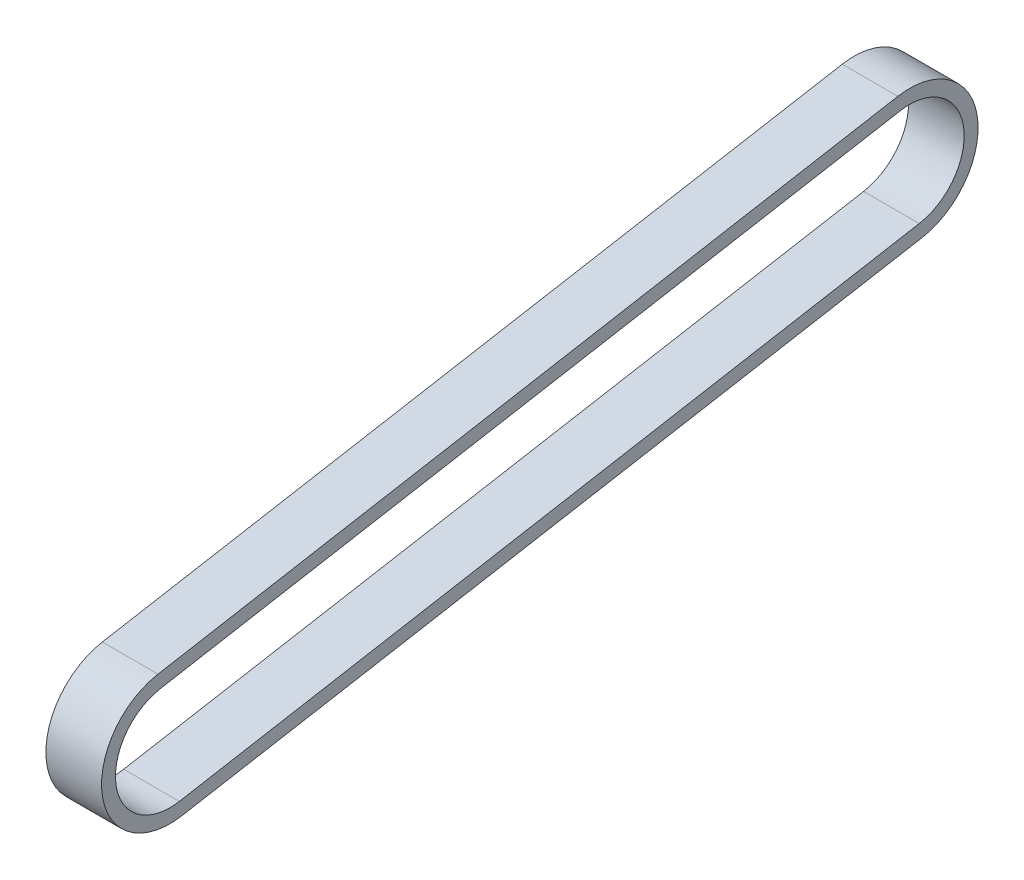
ISO-10303-21;
HEADER;
FILE_DESCRIPTION(('STEP AP214'),'2;1');
FILE_NAME('part.step','',(''),(''),'','','');
FILE_SCHEMA(('AUTOMOTIVE_DESIGN { 1 0 10303 214 1 1 1 1 }'));
ENDSEC;
DATA;
#1=APPLICATION_CONTEXT('core data for automotive mechanical design processes');
#2=APPLICATION_PROTOCOL_DEFINITION('international standard','automotive_design',2000,#1);
#3=PRODUCT_CONTEXT('',#1,'mechanical');
#4=PRODUCT('Part','Part','',(#3));
#5=PRODUCT_RELATED_PRODUCT_CATEGORY('part','',(#4));
#6=PRODUCT_DEFINITION_FORMATION('','',#4);
#7=PRODUCT_DEFINITION_CONTEXT('part definition',#1,'design');
#8=PRODUCT_DEFINITION('design','',#6,#7);
#9=PRODUCT_DEFINITION_SHAPE('','',#8);
#10=(LENGTH_UNIT() NAMED_UNIT(*) SI_UNIT(.MILLI.,.METRE.));
#11=(NAMED_UNIT(*) PLANE_ANGLE_UNIT() SI_UNIT($,.RADIAN.));
#12=(NAMED_UNIT(*) SI_UNIT($,.STERADIAN.) SOLID_ANGLE_UNIT());
#13=UNCERTAINTY_MEASURE_WITH_UNIT(LENGTH_MEASURE(1.E-05),#10,'distance_accuracy_value','');
#14=(GEOMETRIC_REPRESENTATION_CONTEXT(3) GLOBAL_UNCERTAINTY_ASSIGNED_CONTEXT((#13)) GLOBAL_UNIT_ASSIGNED_CONTEXT((#10,
#11,#12)) REPRESENTATION_CONTEXT('',''));
#15=CARTESIAN_POINT('',(0.,0.,0.));
#16=DIRECTION('',(0.,0.,1.));
#17=DIRECTION('',(1.,0.,0.));
#18=AXIS2_PLACEMENT_3D('',#15,#16,#17);
#19=CARTESIAN_POINT('',(-37.4500000000003,70.,-40.0000000000009));
#20=DIRECTION('',(1.,0.,0.));
#21=DIRECTION('',(0.,0.,-1.));
#22=AXIS2_PLACEMENT_3D('',#19,#20,#21);
#23=CYLINDRICAL_SURFACE('',#22,7.366);
#24=CARTESIAN_POINT('',(-31.4500000000003,70.,-40.0000000000008));
#25=DIRECTION('',(-1.,0.,0.));
#26=DIRECTION('',(0.,0.,1.));
#27=AXIS2_PLACEMENT_3D('',#24,#25,#26);
#28=CIRCLE('',#27,7.366);
#29=CARTESIAN_POINT('',(-31.4500000000003,77.2540939086879,-38.7209075233063));
#30=VERTEX_POINT('',#29);
#31=CARTESIAN_POINT('',(-31.4500000000003,62.7459060913121,-41.2790924766954));
#32=VERTEX_POINT('',#31);
#33=EDGE_CURVE('E135',#30,#32,#28,.T.);
#34=ORIENTED_EDGE('',*,*,#33,.T.);
#35=DIRECTION('',(1.,0.,0.));
#36=VECTOR('',#35,1.);
#37=CARTESIAN_POINT('',(-37.4500000000003,62.7459060913121,-41.2790924766955));
#38=LINE('',#37,#36);
#39=CARTESIAN_POINT('',(-37.4500000000003,62.7459060913121,-41.2790924766955));
#40=VERTEX_POINT('',#39);
#41=EDGE_CURVE('E12',#40,#32,#38,.T.);
#42=ORIENTED_EDGE('',*,*,#41,.F.);
#43=CARTESIAN_POINT('',(-37.4500000000003,70.,-40.0000000000009));
#44=DIRECTION('',(-1.,0.,0.));
#45=DIRECTION('',(0.,0.,1.));
#46=AXIS2_PLACEMENT_3D('',#43,#44,#45);
#47=CIRCLE('',#46,7.366);
#48=CARTESIAN_POINT('',(-37.4500000000003,77.2540939086879,-38.7209075233063));
#49=VERTEX_POINT('',#48);
#50=EDGE_CURVE('E165',#49,#40,#47,.T.);
#51=ORIENTED_EDGE('',*,*,#50,.F.);
#52=DIRECTION('',(1.,0.,0.));
#53=VECTOR('',#52,1.);
#54=CARTESIAN_POINT('',(-37.4500000000003,77.2540939086879,-38.7209075233063));
#55=LINE('',#54,#53);
#56=EDGE_CURVE('E176',#49,#30,#55,.T.);
#57=ORIENTED_EDGE('',*,*,#56,.T.);
#58=EDGE_LOOP('',(#34,#42,#51,#57));
#59=FACE_BOUND('',#58,.T.);
#60=ADVANCED_FACE('F63',(#59),#23,.T.);
#61=CARTESIAN_POINT('',(-37.4500000000003,62.7459060913121,-41.2790924766955));
#62=DIRECTION('',(0.,0.984807753012209,0.173648177666924));
#63=DIRECTION('',(0.,-0.173648177666924,0.984807753012209));
#64=AXIS2_PLACEMENT_3D('',#61,#62,#63);
#65=PLANE('',#64);
#66=DIRECTION('',(0.,-0.173648177666924,0.984807753012209));
#67=VECTOR('',#66,1.);
#68=CARTESIAN_POINT('',(-31.4500000000003,62.7459060913121,-41.2790924766954));
#69=LINE('',#68,#67);
#70=CARTESIAN_POINT('',(-31.4500000000008,48.6804037002912,38.4903355172935));
#71=VERTEX_POINT('',#70);
#72=EDGE_CURVE('E179',#32,#71,#69,.T.);
#73=ORIENTED_EDGE('',*,*,#72,.T.);
#74=DIRECTION('',(1.,0.,0.));
#75=VECTOR('',#74,1.);
#76=CARTESIAN_POINT('',(-37.4500000000008,48.6804037002912,38.4903355172935));
#77=LINE('',#76,#75);
#78=CARTESIAN_POINT('',(-37.4500000000008,48.6804037002912,38.4903355172935));
#79=VERTEX_POINT('',#78);
#80=EDGE_CURVE('E70',#79,#71,#77,.T.);
#81=ORIENTED_EDGE('',*,*,#80,.F.);
#82=DIRECTION('',(0.,-0.173648177666924,0.984807753012209));
#83=VECTOR('',#82,1.);
#84=CARTESIAN_POINT('',(-37.4500000000003,62.7459060913121,-41.2790924766955));
#85=LINE('',#84,#83);
#86=EDGE_CURVE('E168',#40,#79,#85,.T.);
#87=ORIENTED_EDGE('',*,*,#86,.F.);
#88=ORIENTED_EDGE('',*,*,#41,.T.);
#89=EDGE_LOOP('',(#73,#81,#87,#88));
#90=FACE_BOUND('',#89,.T.);
#91=ADVANCED_FACE('F205',(#90),#65,.F.);
#92=CARTESIAN_POINT('',(-37.4500000000008,55.9344976089792,39.7694279939881));
#93=DIRECTION('',(1.,0.,0.));
#94=DIRECTION('',(0.,0.,-1.));
#95=AXIS2_PLACEMENT_3D('',#92,#93,#94);
#96=CYLINDRICAL_SURFACE('',#95,7.36600000000001);
#97=CARTESIAN_POINT('',(-31.4500000000008,55.9344976089792,39.7694279939881));
#98=DIRECTION('',(-1.,0.,0.));
#99=DIRECTION('',(0.,0.,1.));
#100=AXIS2_PLACEMENT_3D('',#97,#98,#99);
#101=CIRCLE('',#100,7.36600000000001);
#102=CARTESIAN_POINT('',(-31.4500000000008,63.1885915176671,41.0485204706827));
#103=VERTEX_POINT('',#102);
#104=EDGE_CURVE('E181',#71,#103,#101,.T.);
#105=ORIENTED_EDGE('',*,*,#104,.T.);
#106=DIRECTION('',(1.,0.,0.));
#107=VECTOR('',#106,1.);
#108=CARTESIAN_POINT('',(-37.4500000000008,63.1885915176671,41.0485204706826));
#109=LINE('',#108,#107);
#110=CARTESIAN_POINT('',(-37.4500000000008,63.1885915176671,41.0485204706826));
#111=VERTEX_POINT('',#110);
#112=EDGE_CURVE('E187',#111,#103,#109,.T.);
#113=ORIENTED_EDGE('',*,*,#112,.F.);
#114=CARTESIAN_POINT('',(-37.4500000000008,55.9344976089792,39.7694279939881));
#115=DIRECTION('',(-1.,0.,0.));
#116=DIRECTION('',(0.,0.,1.));
#117=AXIS2_PLACEMENT_3D('',#114,#115,#116);
#118=CIRCLE('',#117,7.36600000000001);
#119=EDGE_CURVE('E171',#79,#111,#118,.T.);
#120=ORIENTED_EDGE('',*,*,#119,.F.);
#121=ORIENTED_EDGE('',*,*,#80,.T.);
#122=EDGE_LOOP('',(#105,#113,#120,#121));
#123=FACE_BOUND('',#122,.T.);
#124=ADVANCED_FACE('F193',(#123),#96,.T.);
#125=CARTESIAN_POINT('',(-37.4500000000003,77.2540939086879,-38.7209075233063));
#126=DIRECTION('',(0.,0.984807753012209,0.173648177666924));
#127=DIRECTION('',(0.,-0.173648177666924,0.984807753012209));
#128=AXIS2_PLACEMENT_3D('',#125,#126,#127);
#129=PLANE('',#128);
#130=DIRECTION('',(0.,-0.173648177666924,0.984807753012209));
#131=VECTOR('',#130,1.);
#132=CARTESIAN_POINT('',(-31.4500000000003,77.2540939086879,-38.7209075233063));
#133=LINE('',#132,#131);
#134=EDGE_CURVE('E169',#30,#103,#133,.T.);
#135=ORIENTED_EDGE('',*,*,#134,.F.);
#136=ORIENTED_EDGE('',*,*,#56,.F.);
#137=DIRECTION('',(0.,-0.173648177666924,0.984807753012209));
#138=VECTOR('',#137,1.);
#139=CARTESIAN_POINT('',(-37.4500000000003,77.2540939086879,-38.7209075233063));
#140=LINE('',#139,#138);
#141=EDGE_CURVE('E173',#49,#111,#140,.T.);
#142=ORIENTED_EDGE('',*,*,#141,.T.);
#143=ORIENTED_EDGE('',*,*,#112,.T.);
#144=EDGE_LOOP('',(#135,#136,#142,#143));
#145=FACE_BOUND('',#144,.T.);
#146=ADVANCED_FACE('F201',(#145),#129,.T.);
#147=CARTESIAN_POINT('',(-37.4500000000003,70.,-40.0000000000009));
#148=DIRECTION('',(-1.,0.,0.));
#149=DIRECTION('',(0.,0.,1.));
#150=AXIS2_PLACEMENT_3D('',#147,#148,#149);
#151=PLANE('',#150);
#152=DIRECTION('',(0.,-0.173648177666924,0.984807753012209));
#153=VECTOR('',#152,1.);
#154=CARTESIAN_POINT('',(-37.4500000000006,66.8257211401633,11.7831776423102));
#155=LINE('',#154,#153);
#156=CARTESIAN_POINT('',(-37.4500000000003,75.7768822791697,-38.9813797898067));
#157=VERTEX_POINT('',#156);
#158=CARTESIAN_POINT('',(-37.4500000000008,61.7113798881488,40.7880482041823));
#159=VERTEX_POINT('',#158);
#160=EDGE_CURVE('E139',#157,#159,#155,.T.);
#161=ORIENTED_EDGE('',*,*,#160,.T.);
#162=CARTESIAN_POINT('',(-37.4500000000008,55.9344976089792,39.7694279939881));
#163=DIRECTION('',(-1.,0.,0.));
#164=DIRECTION('',(0.,0.,1.));
#165=AXIS2_PLACEMENT_3D('',#162,#163,#164);
#166=CIRCLE('',#165,5.866);
#167=CARTESIAN_POINT('',(-37.4500000000008,50.1576153298095,38.7508077837939));
#168=VERTEX_POINT('',#167);
#169=EDGE_CURVE('E151',#168,#159,#166,.T.);
#170=ORIENTED_EDGE('',*,*,#169,.F.);
#171=DIRECTION('',(0.,-0.173648177666924,0.984807753012209));
#172=VECTOR('',#171,1.);
#173=CARTESIAN_POINT('',(-37.4500000000006,55.2719565818241,9.74593722192179));
#174=LINE('',#173,#172);
#175=CARTESIAN_POINT('',(-37.4500000000003,64.2231177208304,-41.0186202101951));
#176=VERTEX_POINT('',#175);
#177=EDGE_CURVE('E149',#176,#168,#174,.T.);
#178=ORIENTED_EDGE('',*,*,#177,.F.);
#179=CARTESIAN_POINT('',(-37.4500000000003,70.,-40.0000000000009));
#180=DIRECTION('',(-1.,0.,0.));
#181=DIRECTION('',(0.,0.,1.));
#182=AXIS2_PLACEMENT_3D('',#179,#180,#181);
#183=CIRCLE('',#182,5.866);
#184=EDGE_CURVE('E131',#157,#176,#183,.T.);
#185=ORIENTED_EDGE('',*,*,#184,.F.);
#186=EDGE_LOOP('',(#161,#170,#178,#185));
#187=FACE_BOUND('',#186,.T.);
#188=ORIENTED_EDGE('',*,*,#50,.T.);
#189=ORIENTED_EDGE('',*,*,#86,.T.);
#190=ORIENTED_EDGE('',*,*,#119,.T.);
#191=ORIENTED_EDGE('',*,*,#141,.F.);
#192=EDGE_LOOP('',(#188,#189,#190,#191));
#193=FACE_BOUND('',#192,.T.);
#194=ADVANCED_FACE('F147',(#187,#193),#151,.T.);
#195=CARTESIAN_POINT('',(-31.4500000000003,70.,-40.0000000000008));
#196=DIRECTION('',(-1.,0.,0.));
#197=DIRECTION('',(0.,0.,1.));
#198=AXIS2_PLACEMENT_3D('',#195,#196,#197);
#199=PLANE('',#198);
#200=CARTESIAN_POINT('',(-31.4500000000008,55.9344976089792,39.7694279939881));
#201=DIRECTION('',(-1.,0.,0.));
#202=DIRECTION('',(0.,0.,1.));
#203=AXIS2_PLACEMENT_3D('',#200,#201,#202);
#204=CIRCLE('',#203,5.866);
#205=CARTESIAN_POINT('',(-31.4500000000008,50.1576153298095,38.7508077837939));
#206=VERTEX_POINT('',#205);
#207=CARTESIAN_POINT('',(-31.4500000000008,61.7113798881488,40.7880482041823));
#208=VERTEX_POINT('',#207);
#209=EDGE_CURVE('E144',#206,#208,#204,.T.);
#210=ORIENTED_EDGE('',*,*,#209,.T.);
#211=DIRECTION('',(0.,-0.173648177666924,0.984807753012209));
#212=VECTOR('',#211,1.);
#213=CARTESIAN_POINT('',(-31.4500000000006,66.8257211401633,11.7831776423102));
#214=LINE('',#213,#212);
#215=CARTESIAN_POINT('',(-31.4500000000003,75.7768822791697,-38.9813797898067));
#216=VERTEX_POINT('',#215);
#217=EDGE_CURVE('E85',#216,#208,#214,.T.);
#218=ORIENTED_EDGE('',*,*,#217,.F.);
#219=CARTESIAN_POINT('',(-31.4500000000003,70.,-40.0000000000008));
#220=DIRECTION('',(-1.,0.,0.));
#221=DIRECTION('',(0.,0.,1.));
#222=AXIS2_PLACEMENT_3D('',#219,#220,#221);
#223=CIRCLE('',#222,5.866);
#224=CARTESIAN_POINT('',(-31.4500000000003,64.2231177208304,-41.018620210195));
#225=VERTEX_POINT('',#224);
#226=EDGE_CURVE('E134',#216,#225,#223,.T.);
#227=ORIENTED_EDGE('',*,*,#226,.T.);
#228=DIRECTION('',(0.,-0.173648177666924,0.984807753012209));
#229=VECTOR('',#228,1.);
#230=CARTESIAN_POINT('',(-31.4500000000006,55.2719565818241,9.74593722192184));
#231=LINE('',#230,#229);
#232=EDGE_CURVE('E157',#225,#206,#231,.T.);
#233=ORIENTED_EDGE('',*,*,#232,.T.);
#234=EDGE_LOOP('',(#210,#218,#227,#233));
#235=FACE_BOUND('',#234,.T.);
#236=ORIENTED_EDGE('',*,*,#33,.F.);
#237=ORIENTED_EDGE('',*,*,#134,.T.);
#238=ORIENTED_EDGE('',*,*,#104,.F.);
#239=ORIENTED_EDGE('',*,*,#72,.F.);
#240=EDGE_LOOP('',(#236,#237,#238,#239));
#241=FACE_BOUND('',#240,.T.);
#242=ADVANCED_FACE('F198',(#235,#241),#199,.F.);
#243=CARTESIAN_POINT('',(-37.4500000000006,66.8257211401633,11.7831776423102));
#244=DIRECTION('',(0.,0.984807753012209,0.173648177666924));
#245=DIRECTION('',(0.,-0.173648177666924,0.984807753012209));
#246=AXIS2_PLACEMENT_3D('',#243,#244,#245);
#247=PLANE('',#246);
#248=ORIENTED_EDGE('',*,*,#217,.T.);
#249=DIRECTION('',(1.,0.,0.));
#250=VECTOR('',#249,1.);
#251=CARTESIAN_POINT('',(-37.4500000000008,61.7113798881488,40.7880482041823));
#252=LINE('',#251,#250);
#253=EDGE_CURVE('E141',#159,#208,#252,.T.);
#254=ORIENTED_EDGE('',*,*,#253,.F.);
#255=ORIENTED_EDGE('',*,*,#160,.F.);
#256=DIRECTION('',(1.,0.,0.));
#257=VECTOR('',#256,1.);
#258=CARTESIAN_POINT('',(-37.4500000000003,75.7768822791697,-38.9813797898067));
#259=LINE('',#258,#257);
#260=EDGE_CURVE('E127',#157,#216,#259,.T.);
#261=ORIENTED_EDGE('',*,*,#260,.T.);
#262=EDGE_LOOP('',(#248,#254,#255,#261));
#263=FACE_BOUND('',#262,.T.);
#264=ADVANCED_FACE('F140',(#263),#247,.F.);
#265=CARTESIAN_POINT('',(-37.4500000000003,70.,-40.0000000000009));
#266=DIRECTION('',(1.,0.,0.));
#267=DIRECTION('',(0.,0.,-1.));
#268=AXIS2_PLACEMENT_3D('',#265,#266,#267);
#269=CYLINDRICAL_SURFACE('',#268,5.866);
#270=ORIENTED_EDGE('',*,*,#226,.F.);
#271=ORIENTED_EDGE('',*,*,#260,.F.);
#272=ORIENTED_EDGE('',*,*,#184,.T.);
#273=DIRECTION('',(1.,0.,0.));
#274=VECTOR('',#273,1.);
#275=CARTESIAN_POINT('',(-37.4500000000003,64.2231177208304,-41.0186202101951));
#276=LINE('',#275,#274);
#277=EDGE_CURVE('E136',#176,#225,#276,.T.);
#278=ORIENTED_EDGE('',*,*,#277,.T.);
#279=EDGE_LOOP('',(#270,#271,#272,#278));
#280=FACE_BOUND('',#279,.T.);
#281=ADVANCED_FACE('F129',(#280),#269,.F.);
#282=CARTESIAN_POINT('',(-37.4500000000006,55.2719565818241,9.74593722192179));
#283=DIRECTION('',(0.,0.984807753012209,0.173648177666924));
#284=DIRECTION('',(0.,-0.173648177666924,0.984807753012209));
#285=AXIS2_PLACEMENT_3D('',#282,#283,#284);
#286=PLANE('',#285);
#287=ORIENTED_EDGE('',*,*,#232,.F.);
#288=ORIENTED_EDGE('',*,*,#277,.F.);
#289=ORIENTED_EDGE('',*,*,#177,.T.);
#290=DIRECTION('',(1.,0.,0.));
#291=VECTOR('',#290,1.);
#292=CARTESIAN_POINT('',(-37.4500000000008,50.1576153298095,38.7508077837939));
#293=LINE('',#292,#291);
#294=EDGE_CURVE('E77',#168,#206,#293,.T.);
#295=ORIENTED_EDGE('',*,*,#294,.T.);
#296=EDGE_LOOP('',(#287,#288,#289,#295));
#297=FACE_BOUND('',#296,.T.);
#298=ADVANCED_FACE('F227',(#297),#286,.T.);
#299=CARTESIAN_POINT('',(-37.4500000000008,55.9344976089792,39.7694279939881));
#300=DIRECTION('',(1.,0.,0.));
#301=DIRECTION('',(0.,0.,-1.));
#302=AXIS2_PLACEMENT_3D('',#299,#300,#301);
#303=CYLINDRICAL_SURFACE('',#302,5.866);
#304=ORIENTED_EDGE('',*,*,#209,.F.);
#305=ORIENTED_EDGE('',*,*,#294,.F.);
#306=ORIENTED_EDGE('',*,*,#169,.T.);
#307=ORIENTED_EDGE('',*,*,#253,.T.);
#308=EDGE_LOOP('',(#304,#305,#306,#307));
#309=FACE_BOUND('',#308,.T.);
#310=ADVANCED_FACE('F230',(#309),#303,.F.);
#311=CLOSED_SHELL('',(#60,#91,#124,#146,#194,#242,#264,#281,#298,#310));
#312=MANIFOLD_SOLID_BREP('B2',#311);
#313=ADVANCED_BREP_SHAPE_REPRESENTATION('',(#18,#312),#14);
#314=SHAPE_DEFINITION_REPRESENTATION(#9,#313);
ENDSEC;
END-ISO-10303-21;
